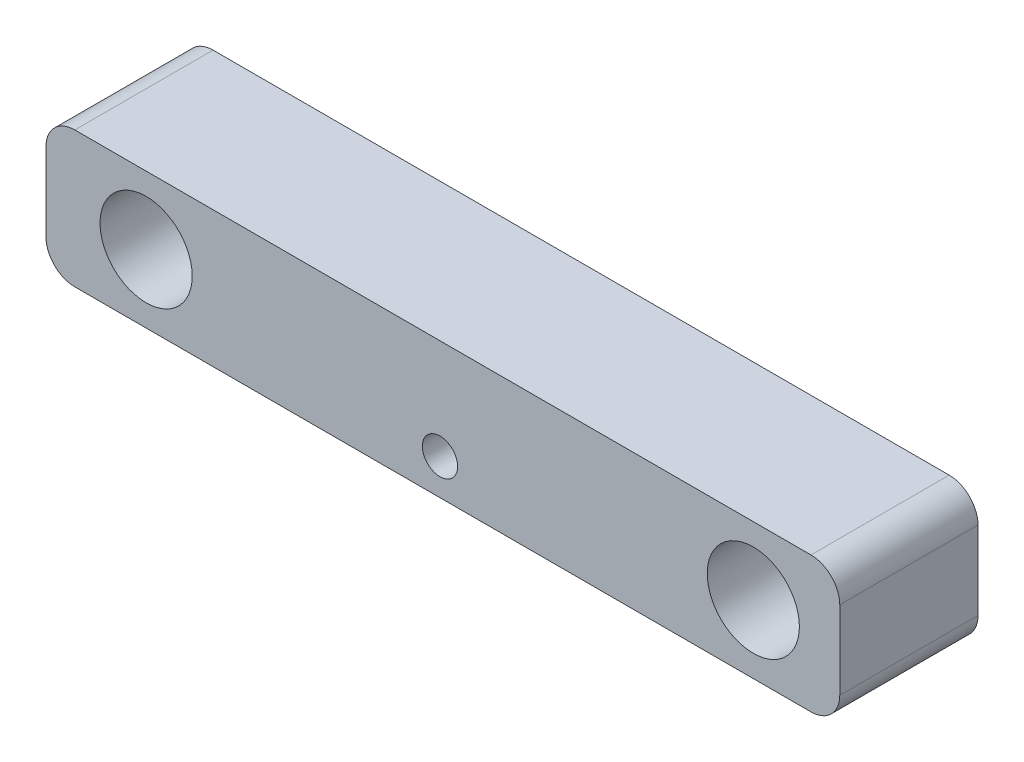
ISO-10303-21;
HEADER;
FILE_DESCRIPTION(('STEP AP214'),'2;1');
FILE_NAME('part.step','',(''),(''),'','','');
FILE_SCHEMA(('AUTOMOTIVE_DESIGN { 1 0 10303 214 1 1 1 1 }'));
ENDSEC;
DATA;
#1=APPLICATION_CONTEXT('core data for automotive mechanical design processes');
#2=APPLICATION_PROTOCOL_DEFINITION('international standard','automotive_design',2000,#1);
#3=PRODUCT_CONTEXT('',#1,'mechanical');
#4=PRODUCT('Part','Part','',(#3));
#5=PRODUCT_RELATED_PRODUCT_CATEGORY('part','',(#4));
#6=PRODUCT_DEFINITION_FORMATION('','',#4);
#7=PRODUCT_DEFINITION_CONTEXT('part definition',#1,'design');
#8=PRODUCT_DEFINITION('design','',#6,#7);
#9=PRODUCT_DEFINITION_SHAPE('','',#8);
#10=(LENGTH_UNIT() NAMED_UNIT(*) SI_UNIT(.MILLI.,.METRE.));
#11=(NAMED_UNIT(*) PLANE_ANGLE_UNIT() SI_UNIT($,.RADIAN.));
#12=(NAMED_UNIT(*) SI_UNIT($,.STERADIAN.) SOLID_ANGLE_UNIT());
#13=UNCERTAINTY_MEASURE_WITH_UNIT(LENGTH_MEASURE(1.E-05),#10,'distance_accuracy_value','');
#14=(GEOMETRIC_REPRESENTATION_CONTEXT(3) GLOBAL_UNCERTAINTY_ASSIGNED_CONTEXT((#13)) GLOBAL_UNIT_ASSIGNED_CONTEXT((#10,
#11,#12)) REPRESENTATION_CONTEXT('',''));
#15=CARTESIAN_POINT('',(0.,0.,0.));
#16=DIRECTION('',(0.,0.,1.));
#17=DIRECTION('',(1.,0.,0.));
#18=AXIS2_PLACEMENT_3D('',#15,#16,#17);
#19=CARTESIAN_POINT('',(0.,0.,30.48));
#20=DIRECTION('',(0.,0.,1.));
#21=DIRECTION('',(1.,0.,0.));
#22=AXIS2_PLACEMENT_3D('',#19,#20,#21);
#23=PLANE('',#22);
#24=CARTESIAN_POINT('',(-72.793003422337,-2.42346559472395,30.48));
#25=DIRECTION('',(0.,0.,1.));
#26=DIRECTION('',(1.,0.,0.));
#27=AXIS2_PLACEMENT_3D('',#24,#25,#26);
#28=CIRCLE('',#27,3.88733842107939);
#29=CARTESIAN_POINT('',(-68.9056650012576,-2.42346559472395,30.48));
#30=VERTEX_POINT('',#29);
#31=EDGE_CURVE('E189',#30,#30,#28,.T.);
#32=ORIENTED_EDGE('',*,*,#31,.F.);
#33=EDGE_LOOP('',(#32));
#34=FACE_BOUND('',#33,.T.);
#35=CARTESIAN_POINT('',(-137.583333333333,4.66724999999998,30.48));
#36=DIRECTION('',(0.,0.,1.));
#37=DIRECTION('',(1.,0.,0.));
#38=AXIS2_PLACEMENT_3D('',#35,#36,#37);
#39=CIRCLE('',#38,10.16);
#40=CARTESIAN_POINT('',(-127.423333333333,4.66724999999998,30.48));
#41=VERTEX_POINT('',#40);
#42=EDGE_CURVE('E127',#41,#41,#39,.T.);
#43=ORIENTED_EDGE('',*,*,#42,.F.);
#44=EDGE_LOOP('',(#43));
#45=FACE_BOUND('',#44,.T.);
#46=DIRECTION('',(1.,0.,0.));
#47=VECTOR('',#46,1.);
#48=CARTESIAN_POINT('',(-159.660166666667,-10.31875,30.48));
#49=LINE('',#48,#47);
#50=CARTESIAN_POINT('',(-153.310166666667,-10.31875,30.48));
#51=VERTEX_POINT('',#50);
#52=CARTESIAN_POINT('',(8.99583333333329,-10.31875,30.48));
#53=VERTEX_POINT('',#52);
#54=EDGE_CURVE('E136',#51,#53,#49,.T.);
#55=ORIENTED_EDGE('',*,*,#54,.T.);
#56=CARTESIAN_POINT('',(8.99583333333328,-3.96875000000002,30.48));
#57=DIRECTION('',(0.,0.,1.));
#58=DIRECTION('',(1.,0.,0.));
#59=AXIS2_PLACEMENT_3D('',#56,#57,#58);
#60=CIRCLE('',#59,6.35);
#61=CARTESIAN_POINT('',(15.3458333333333,-3.96875000000002,30.48));
#62=VERTEX_POINT('',#61);
#63=EDGE_CURVE('E155',#53,#62,#60,.T.);
#64=ORIENTED_EDGE('',*,*,#63,.T.);
#65=DIRECTION('',(0.,1.,0.));
#66=VECTOR('',#65,1.);
#67=CARTESIAN_POINT('',(15.3458333333333,19.65325,30.48));
#68=LINE('',#67,#66);
#69=CARTESIAN_POINT('',(15.3458333333333,13.30325,30.48));
#70=VERTEX_POINT('',#69);
#71=EDGE_CURVE('E119',#62,#70,#68,.T.);
#72=ORIENTED_EDGE('',*,*,#71,.T.);
#73=CARTESIAN_POINT('',(8.99583333333326,13.30325,30.48));
#74=DIRECTION('',(0.,0.,1.));
#75=DIRECTION('',(1.,0.,0.));
#76=AXIS2_PLACEMENT_3D('',#73,#74,#75);
#77=CIRCLE('',#76,6.35);
#78=CARTESIAN_POINT('',(8.99583333333326,19.65325,30.48));
#79=VERTEX_POINT('',#78);
#80=EDGE_CURVE('E150',#70,#79,#77,.T.);
#81=ORIENTED_EDGE('',*,*,#80,.T.);
#82=DIRECTION('',(-1.,0.,0.));
#83=VECTOR('',#82,1.);
#84=CARTESIAN_POINT('',(-159.660166666667,19.65325,30.48));
#85=LINE('',#84,#83);
#86=CARTESIAN_POINT('',(-153.310166666667,19.65325,30.48));
#87=VERTEX_POINT('',#86);
#88=EDGE_CURVE('E166',#79,#87,#85,.T.);
#89=ORIENTED_EDGE('',*,*,#88,.T.);
#90=CARTESIAN_POINT('',(-153.310166666667,13.30325,30.48));
#91=DIRECTION('',(0.,0.,1.));
#92=DIRECTION('',(1.,0.,0.));
#93=AXIS2_PLACEMENT_3D('',#90,#91,#92);
#94=CIRCLE('',#93,6.35);
#95=CARTESIAN_POINT('',(-159.660166666667,13.30325,30.48));
#96=VERTEX_POINT('',#95);
#97=EDGE_CURVE('E55',#87,#96,#94,.T.);
#98=ORIENTED_EDGE('',*,*,#97,.T.);
#99=DIRECTION('',(0.,-1.,0.));
#100=VECTOR('',#99,1.);
#101=CARTESIAN_POINT('',(-159.660166666667,19.65325,30.48));
#102=LINE('',#101,#100);
#103=CARTESIAN_POINT('',(-159.660166666667,-3.96875000000002,30.48));
#104=VERTEX_POINT('',#103);
#105=EDGE_CURVE('E174',#96,#104,#102,.T.);
#106=ORIENTED_EDGE('',*,*,#105,.T.);
#107=CARTESIAN_POINT('',(-153.310166666667,-3.96875000000003,30.48));
#108=DIRECTION('',(0.,0.,1.));
#109=DIRECTION('',(1.,0.,0.));
#110=AXIS2_PLACEMENT_3D('',#107,#108,#109);
#111=CIRCLE('',#110,6.35);
#112=EDGE_CURVE('E153',#104,#51,#111,.T.);
#113=ORIENTED_EDGE('',*,*,#112,.T.);
#114=EDGE_LOOP('',(#55,#64,#72,#81,#89,#98,#106,#113));
#115=FACE_BOUND('',#114,.T.);
#116=CARTESIAN_POINT('',(-3.71556872705603,4.66724999999998,30.48));
#117=DIRECTION('',(0.,0.,1.));
#118=DIRECTION('',(1.,0.,0.));
#119=AXIS2_PLACEMENT_3D('',#116,#117,#118);
#120=CIRCLE('',#119,10.16);
#121=CARTESIAN_POINT('',(6.44443127294397,4.66724999999998,30.48));
#122=VERTEX_POINT('',#121);
#123=EDGE_CURVE('E181',#122,#122,#120,.T.);
#124=ORIENTED_EDGE('',*,*,#123,.F.);
#125=EDGE_LOOP('',(#124));
#126=FACE_BOUND('',#125,.T.);
#127=ADVANCED_FACE('F33',(#34,#45,#115,#126),#23,.T.);
#128=CARTESIAN_POINT('',(0.,0.,0.));
#129=DIRECTION('',(0.,0.,1.));
#130=DIRECTION('',(1.,0.,0.));
#131=AXIS2_PLACEMENT_3D('',#128,#129,#130);
#132=PLANE('',#131);
#133=DIRECTION('',(0.,1.,0.));
#134=VECTOR('',#133,1.);
#135=CARTESIAN_POINT('',(15.3458333333333,19.65325,0.));
#136=LINE('',#135,#134);
#137=CARTESIAN_POINT('',(15.3458333333333,-3.96875000000002,0.));
#138=VERTEX_POINT('',#137);
#139=CARTESIAN_POINT('',(15.3458333333333,13.30325,0.));
#140=VERTEX_POINT('',#139);
#141=EDGE_CURVE('E116',#138,#140,#136,.T.);
#142=ORIENTED_EDGE('',*,*,#141,.F.);
#143=CARTESIAN_POINT('',(8.99583333333328,-3.96875000000002,0.));
#144=DIRECTION('',(0.,0.,1.));
#145=DIRECTION('',(1.,0.,0.));
#146=AXIS2_PLACEMENT_3D('',#143,#144,#145);
#147=CIRCLE('',#146,6.35);
#148=CARTESIAN_POINT('',(8.99583333333329,-10.31875,0.));
#149=VERTEX_POINT('',#148);
#150=EDGE_CURVE('E99',#138,#149,#147,.F.);
#151=ORIENTED_EDGE('',*,*,#150,.T.);
#152=DIRECTION('',(1.,0.,0.));
#153=VECTOR('',#152,1.);
#154=CARTESIAN_POINT('',(-159.660166666667,-10.31875,0.));
#155=LINE('',#154,#153);
#156=CARTESIAN_POINT('',(-153.310166666667,-10.31875,0.));
#157=VERTEX_POINT('',#156);
#158=EDGE_CURVE('E140',#157,#149,#155,.T.);
#159=ORIENTED_EDGE('',*,*,#158,.F.);
#160=CARTESIAN_POINT('',(-153.310166666667,-3.96875000000003,0.));
#161=DIRECTION('',(0.,0.,1.));
#162=DIRECTION('',(1.,0.,0.));
#163=AXIS2_PLACEMENT_3D('',#160,#161,#162);
#164=CIRCLE('',#163,6.35);
#165=CARTESIAN_POINT('',(-159.660166666667,-3.96875000000002,0.));
#166=VERTEX_POINT('',#165);
#167=EDGE_CURVE('E110',#157,#166,#164,.F.);
#168=ORIENTED_EDGE('',*,*,#167,.T.);
#169=DIRECTION('',(0.,-1.,0.));
#170=VECTOR('',#169,1.);
#171=CARTESIAN_POINT('',(-159.660166666667,19.65325,0.));
#172=LINE('',#171,#170);
#173=CARTESIAN_POINT('',(-159.660166666667,13.30325,0.));
#174=VERTEX_POINT('',#173);
#175=EDGE_CURVE('E130',#174,#166,#172,.T.);
#176=ORIENTED_EDGE('',*,*,#175,.F.);
#177=CARTESIAN_POINT('',(-153.310166666667,13.30325,0.));
#178=DIRECTION('',(0.,0.,1.));
#179=DIRECTION('',(1.,0.,0.));
#180=AXIS2_PLACEMENT_3D('',#177,#178,#179);
#181=CIRCLE('',#180,6.35);
#182=CARTESIAN_POINT('',(-153.310166666667,19.65325,0.));
#183=VERTEX_POINT('',#182);
#184=EDGE_CURVE('E144',#174,#183,#181,.F.);
#185=ORIENTED_EDGE('',*,*,#184,.T.);
#186=DIRECTION('',(-1.,0.,0.));
#187=VECTOR('',#186,1.);
#188=CARTESIAN_POINT('',(-159.660166666667,19.65325,0.));
#189=LINE('',#188,#187);
#190=CARTESIAN_POINT('',(8.99583333333326,19.65325,0.));
#191=VERTEX_POINT('',#190);
#192=EDGE_CURVE('E126',#191,#183,#189,.T.);
#193=ORIENTED_EDGE('',*,*,#192,.F.);
#194=CARTESIAN_POINT('',(8.99583333333326,13.30325,0.));
#195=DIRECTION('',(0.,0.,1.));
#196=DIRECTION('',(1.,0.,0.));
#197=AXIS2_PLACEMENT_3D('',#194,#195,#196);
#198=CIRCLE('',#197,6.35);
#199=EDGE_CURVE('E120',#191,#140,#198,.F.);
#200=ORIENTED_EDGE('',*,*,#199,.T.);
#201=EDGE_LOOP('',(#142,#151,#159,#168,#176,#185,#193,#200));
#202=FACE_BOUND('',#201,.T.);
#203=CARTESIAN_POINT('',(-137.583333333333,4.66724999999998,0.));
#204=DIRECTION('',(0.,0.,1.));
#205=DIRECTION('',(1.,0.,0.));
#206=AXIS2_PLACEMENT_3D('',#203,#204,#205);
#207=CIRCLE('',#206,10.16);
#208=CARTESIAN_POINT('',(-127.423333333333,4.66724999999998,0.));
#209=VERTEX_POINT('',#208);
#210=EDGE_CURVE('E133',#209,#209,#207,.T.);
#211=ORIENTED_EDGE('',*,*,#210,.T.);
#212=EDGE_LOOP('',(#211));
#213=FACE_BOUND('',#212,.T.);
#214=CARTESIAN_POINT('',(-3.71556872705603,4.66724999999998,0.));
#215=DIRECTION('',(0.,0.,1.));
#216=DIRECTION('',(1.,0.,0.));
#217=AXIS2_PLACEMENT_3D('',#214,#215,#216);
#218=CIRCLE('',#217,10.16);
#219=CARTESIAN_POINT('',(6.44443127294397,4.66724999999998,0.));
#220=VERTEX_POINT('',#219);
#221=EDGE_CURVE('E183',#220,#220,#218,.T.);
#222=ORIENTED_EDGE('',*,*,#221,.T.);
#223=EDGE_LOOP('',(#222));
#224=FACE_BOUND('',#223,.T.);
#225=ADVANCED_FACE('F123',(#202,#213,#224),#132,.F.);
#226=CARTESIAN_POINT('',(15.3458333333333,19.65325,30.48));
#227=DIRECTION('',(-1.,0.,0.));
#228=DIRECTION('',(0.,-1.,0.));
#229=AXIS2_PLACEMENT_3D('',#226,#227,#228);
#230=PLANE('',#229);
#231=ORIENTED_EDGE('',*,*,#71,.F.);
#232=DIRECTION('',(0.,0.,-1.));
#233=VECTOR('',#232,1.);
#234=CARTESIAN_POINT('',(15.3458333333333,-3.96875000000002,30.48));
#235=LINE('',#234,#233);
#236=EDGE_CURVE('E103',#62,#138,#235,.T.);
#237=ORIENTED_EDGE('',*,*,#236,.T.);
#238=ORIENTED_EDGE('',*,*,#141,.T.);
#239=DIRECTION('',(0.,0.,-1.));
#240=VECTOR('',#239,1.);
#241=CARTESIAN_POINT('',(15.3458333333333,13.30325,30.48));
#242=LINE('',#241,#240);
#243=EDGE_CURVE('E121',#140,#70,#242,.F.);
#244=ORIENTED_EDGE('',*,*,#243,.T.);
#245=EDGE_LOOP('',(#231,#237,#238,#244));
#246=FACE_BOUND('',#245,.T.);
#247=ADVANCED_FACE('F115',(#246),#230,.F.);
#248=CARTESIAN_POINT('',(-159.660166666667,19.65325,30.48));
#249=DIRECTION('',(0.,-1.,0.));
#250=DIRECTION('',(0.,0.,-1.));
#251=AXIS2_PLACEMENT_3D('',#248,#249,#250);
#252=PLANE('',#251);
#253=ORIENTED_EDGE('',*,*,#192,.T.);
#254=DIRECTION('',(0.,0.,-1.));
#255=VECTOR('',#254,1.);
#256=CARTESIAN_POINT('',(-153.310166666667,19.65325,30.48));
#257=LINE('',#256,#255);
#258=EDGE_CURVE('E11',#183,#87,#257,.F.);
#259=ORIENTED_EDGE('',*,*,#258,.T.);
#260=ORIENTED_EDGE('',*,*,#88,.F.);
#261=DIRECTION('',(0.,0.,-1.));
#262=VECTOR('',#261,1.);
#263=CARTESIAN_POINT('',(8.99583333333326,19.65325,30.48));
#264=LINE('',#263,#262);
#265=EDGE_CURVE('E41',#79,#191,#264,.T.);
#266=ORIENTED_EDGE('',*,*,#265,.T.);
#267=EDGE_LOOP('',(#253,#259,#260,#266));
#268=FACE_BOUND('',#267,.T.);
#269=ADVANCED_FACE('F164',(#268),#252,.F.);
#270=CARTESIAN_POINT('',(-159.660166666667,19.65325,30.48));
#271=DIRECTION('',(1.,0.,0.));
#272=DIRECTION('',(0.,0.,-1.));
#273=AXIS2_PLACEMENT_3D('',#270,#271,#272);
#274=PLANE('',#273);
#275=ORIENTED_EDGE('',*,*,#175,.T.);
#276=DIRECTION('',(0.,0.,-1.));
#277=VECTOR('',#276,1.);
#278=CARTESIAN_POINT('',(-159.660166666667,-3.96875000000002,30.48));
#279=LINE('',#278,#277);
#280=EDGE_CURVE('E48',#166,#104,#279,.F.);
#281=ORIENTED_EDGE('',*,*,#280,.T.);
#282=ORIENTED_EDGE('',*,*,#105,.F.);
#283=DIRECTION('',(0.,0.,-1.));
#284=VECTOR('',#283,1.);
#285=CARTESIAN_POINT('',(-159.660166666667,13.30325,30.48));
#286=LINE('',#285,#284);
#287=EDGE_CURVE('E157',#96,#174,#286,.T.);
#288=ORIENTED_EDGE('',*,*,#287,.T.);
#289=EDGE_LOOP('',(#275,#281,#282,#288));
#290=FACE_BOUND('',#289,.T.);
#291=ADVANCED_FACE('F173',(#290),#274,.F.);
#292=CARTESIAN_POINT('',(-159.660166666667,-10.31875,30.48));
#293=DIRECTION('',(0.,1.,0.));
#294=DIRECTION('',(0.,0.,1.));
#295=AXIS2_PLACEMENT_3D('',#292,#293,#294);
#296=PLANE('',#295);
#297=ORIENTED_EDGE('',*,*,#158,.T.);
#298=DIRECTION('',(0.,0.,-1.));
#299=VECTOR('',#298,1.);
#300=CARTESIAN_POINT('',(8.99583333333329,-10.31875,30.48));
#301=LINE('',#300,#299);
#302=EDGE_CURVE('E104',#149,#53,#301,.F.);
#303=ORIENTED_EDGE('',*,*,#302,.T.);
#304=ORIENTED_EDGE('',*,*,#54,.F.);
#305=DIRECTION('',(0.,0.,-1.));
#306=VECTOR('',#305,1.);
#307=CARTESIAN_POINT('',(-153.310166666667,-10.31875,30.48));
#308=LINE('',#307,#306);
#309=EDGE_CURVE('E109',#51,#157,#308,.T.);
#310=ORIENTED_EDGE('',*,*,#309,.T.);
#311=EDGE_LOOP('',(#297,#303,#304,#310));
#312=FACE_BOUND('',#311,.T.);
#313=ADVANCED_FACE('F226',(#312),#296,.F.);
#314=CARTESIAN_POINT('',(-137.583333333333,4.66724999999998,30.48));
#315=DIRECTION('',(0.,0.,-1.));
#316=DIRECTION('',(-1.,0.,0.));
#317=AXIS2_PLACEMENT_3D('',#314,#315,#316);
#318=CYLINDRICAL_SURFACE('',#317,10.16);
#319=ORIENTED_EDGE('',*,*,#42,.T.);
#320=EDGE_LOOP('',(#319));
#321=FACE_BOUND('',#320,.T.);
#322=ORIENTED_EDGE('',*,*,#210,.F.);
#323=EDGE_LOOP('',(#322));
#324=FACE_BOUND('',#323,.T.);
#325=ADVANCED_FACE('F214',(#321,#324),#318,.F.);
#326=CARTESIAN_POINT('',(-3.71556872705603,4.66724999999998,30.48));
#327=DIRECTION('',(0.,0.,-1.));
#328=DIRECTION('',(-1.,0.,0.));
#329=AXIS2_PLACEMENT_3D('',#326,#327,#328);
#330=CYLINDRICAL_SURFACE('',#329,10.16);
#331=ORIENTED_EDGE('',*,*,#123,.T.);
#332=EDGE_LOOP('',(#331));
#333=FACE_BOUND('',#332,.T.);
#334=ORIENTED_EDGE('',*,*,#221,.F.);
#335=EDGE_LOOP('',(#334));
#336=FACE_BOUND('',#335,.T.);
#337=ADVANCED_FACE('F200',(#333,#336),#330,.F.);
#338=CARTESIAN_POINT('',(-72.793003422337,-2.42346559472395,22.86));
#339=DIRECTION('',(0.,0.,1.));
#340=DIRECTION('',(1.,0.,0.));
#341=AXIS2_PLACEMENT_3D('',#338,#339,#340);
#342=CYLINDRICAL_SURFACE('',#341,3.88733842107939);
#343=CARTESIAN_POINT('',(-72.793003422337,-2.42346559472395,22.86));
#344=DIRECTION('',(0.,0.,1.));
#345=DIRECTION('',(1.,0.,0.));
#346=AXIS2_PLACEMENT_3D('',#343,#344,#345);
#347=CIRCLE('',#346,3.88733842107939);
#348=CARTESIAN_POINT('',(-68.9056650012576,-2.42346559472395,22.86));
#349=VERTEX_POINT('',#348);
#350=EDGE_CURVE('E186',#349,#349,#347,.T.);
#351=ORIENTED_EDGE('',*,*,#350,.F.);
#352=EDGE_LOOP('',(#351));
#353=FACE_BOUND('',#352,.T.);
#354=ORIENTED_EDGE('',*,*,#31,.T.);
#355=EDGE_LOOP('',(#354));
#356=FACE_BOUND('',#355,.T.);
#357=ADVANCED_FACE('F197',(#353,#356),#342,.F.);
#358=CARTESIAN_POINT('',(-72.793003422337,-2.42346559472395,22.86));
#359=DIRECTION('',(0.,0.,1.));
#360=DIRECTION('',(1.,0.,0.));
#361=AXIS2_PLACEMENT_3D('',#358,#359,#360);
#362=PLANE('',#361);
#363=ORIENTED_EDGE('',*,*,#350,.T.);
#364=EDGE_LOOP('',(#363));
#365=FACE_BOUND('',#364,.T.);
#366=ADVANCED_FACE('F195',(#365),#362,.T.);
#367=CARTESIAN_POINT('',(8.99583333333328,-3.96875000000002,30.48));
#368=DIRECTION('',(0.,0.,-1.));
#369=DIRECTION('',(-1.,0.,0.));
#370=AXIS2_PLACEMENT_3D('',#367,#368,#369);
#371=CYLINDRICAL_SURFACE('',#370,6.35);
#372=ORIENTED_EDGE('',*,*,#63,.F.);
#373=ORIENTED_EDGE('',*,*,#302,.F.);
#374=ORIENTED_EDGE('',*,*,#150,.F.);
#375=ORIENTED_EDGE('',*,*,#236,.F.);
#376=EDGE_LOOP('',(#372,#373,#374,#375));
#377=FACE_BOUND('',#376,.T.);
#378=ADVANCED_FACE('F102',(#377),#371,.T.);
#379=CARTESIAN_POINT('',(-153.310166666667,-3.96875000000003,30.48));
#380=DIRECTION('',(0.,0.,-1.));
#381=DIRECTION('',(-1.,0.,0.));
#382=AXIS2_PLACEMENT_3D('',#379,#380,#381);
#383=CYLINDRICAL_SURFACE('',#382,6.35);
#384=ORIENTED_EDGE('',*,*,#112,.F.);
#385=ORIENTED_EDGE('',*,*,#280,.F.);
#386=ORIENTED_EDGE('',*,*,#167,.F.);
#387=ORIENTED_EDGE('',*,*,#309,.F.);
#388=EDGE_LOOP('',(#384,#385,#386,#387));
#389=FACE_BOUND('',#388,.T.);
#390=ADVANCED_FACE('F236',(#389),#383,.T.);
#391=CARTESIAN_POINT('',(-153.310166666667,13.30325,30.48));
#392=DIRECTION('',(0.,0.,-1.));
#393=DIRECTION('',(-1.,0.,0.));
#394=AXIS2_PLACEMENT_3D('',#391,#392,#393);
#395=CYLINDRICAL_SURFACE('',#394,6.35);
#396=ORIENTED_EDGE('',*,*,#97,.F.);
#397=ORIENTED_EDGE('',*,*,#258,.F.);
#398=ORIENTED_EDGE('',*,*,#184,.F.);
#399=ORIENTED_EDGE('',*,*,#287,.F.);
#400=EDGE_LOOP('',(#396,#397,#398,#399));
#401=FACE_BOUND('',#400,.T.);
#402=ADVANCED_FACE('F172',(#401),#395,.T.);
#403=CARTESIAN_POINT('',(8.99583333333326,13.30325,30.48));
#404=DIRECTION('',(0.,0.,-1.));
#405=DIRECTION('',(-1.,0.,0.));
#406=AXIS2_PLACEMENT_3D('',#403,#404,#405);
#407=CYLINDRICAL_SURFACE('',#406,6.35);
#408=ORIENTED_EDGE('',*,*,#80,.F.);
#409=ORIENTED_EDGE('',*,*,#243,.F.);
#410=ORIENTED_EDGE('',*,*,#199,.F.);
#411=ORIENTED_EDGE('',*,*,#265,.F.);
#412=EDGE_LOOP('',(#408,#409,#410,#411));
#413=FACE_BOUND('',#412,.T.);
#414=ADVANCED_FACE('F35',(#413),#407,.T.);
#415=CLOSED_SHELL('',(#127,#225,#247,#269,#291,#313,#325,#337,#357,#366,#378,#390,#402,#414));
#416=MANIFOLD_SOLID_BREP('B2',#415);
#417=ADVANCED_BREP_SHAPE_REPRESENTATION('',(#18,#416),#14);
#418=SHAPE_DEFINITION_REPRESENTATION(#9,#417);
ENDSEC;
END-ISO-10303-21;
